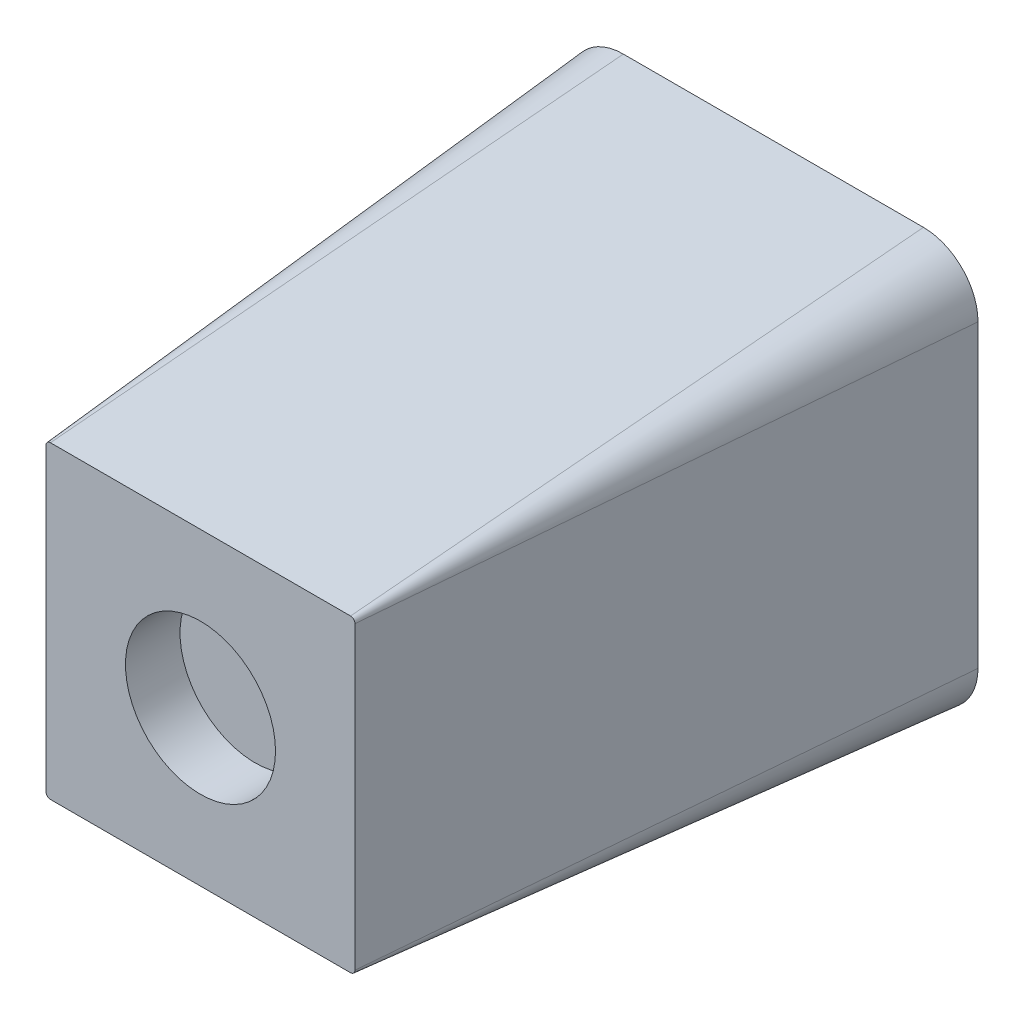
ISO-10303-21;
HEADER;
FILE_DESCRIPTION(('STEP AP214'),'2;1');
FILE_NAME('part.step','',(''),(''),'','','');
FILE_SCHEMA(('AUTOMOTIVE_DESIGN { 1 0 10303 214 1 1 1 1 }'));
ENDSEC;
DATA;
#1=APPLICATION_CONTEXT('core data for automotive mechanical design processes');
#2=APPLICATION_PROTOCOL_DEFINITION('international standard','automotive_design',2000,#1);
#3=PRODUCT_CONTEXT('',#1,'mechanical');
#4=PRODUCT('Part','Part','',(#3));
#5=PRODUCT_RELATED_PRODUCT_CATEGORY('part','',(#4));
#6=PRODUCT_DEFINITION_FORMATION('','',#4);
#7=PRODUCT_DEFINITION_CONTEXT('part definition',#1,'design');
#8=PRODUCT_DEFINITION('design','',#6,#7);
#9=PRODUCT_DEFINITION_SHAPE('','',#8);
#10=(LENGTH_UNIT() NAMED_UNIT(*) SI_UNIT(.MILLI.,.METRE.));
#11=(NAMED_UNIT(*) PLANE_ANGLE_UNIT() SI_UNIT($,.RADIAN.));
#12=(NAMED_UNIT(*) SI_UNIT($,.STERADIAN.) SOLID_ANGLE_UNIT());
#13=UNCERTAINTY_MEASURE_WITH_UNIT(LENGTH_MEASURE(1.E-05),#10,'distance_accuracy_value','');
#14=(GEOMETRIC_REPRESENTATION_CONTEXT(3) GLOBAL_UNCERTAINTY_ASSIGNED_CONTEXT((#13)) GLOBAL_UNIT_ASSIGNED_CONTEXT((#10,
#11,#12)) REPRESENTATION_CONTEXT('',''));
#15=CARTESIAN_POINT('',(0.,0.,0.));
#16=DIRECTION('',(0.,0.,1.));
#17=DIRECTION('',(1.,0.,0.));
#18=AXIS2_PLACEMENT_3D('',#15,#16,#17);
#19=CARTESIAN_POINT('',(-5.5,-5.5,0.));
#20=DIRECTION('',(0.,0.,-1.));
#21=DIRECTION('',(-1.,0.,0.));
#22=AXIS2_PLACEMENT_3D('',#19,#20,#21);
#23=CONICAL_SURFACE('',#22,2.,0.0872664625997167);
#24=CARTESIAN_POINT('',(-5.5,-5.5,0.));
#25=DIRECTION('',(0.,0.,1.));
#26=DIRECTION('',(-1.,0.,0.));
#27=AXIS2_PLACEMENT_3D('',#24,#25,#26);
#28=CIRCLE('',#27,2.);
#29=CARTESIAN_POINT('',(-7.5,-5.49999999999999,0.));
#30=VERTEX_POINT('',#29);
#31=CARTESIAN_POINT('',(-5.49999999999998,-7.5,0.));
#32=VERTEX_POINT('',#31);
#33=EDGE_CURVE('E111',#30,#32,#28,.T.);
#34=ORIENTED_EDGE('',*,*,#33,.T.);
#35=DIRECTION('',(0.,-0.0871557427476584,-0.996194698091745));
#36=VECTOR('',#35,1.);
#37=CARTESIAN_POINT('',(-5.49999999999998,-7.5,0.));
#38=LINE('',#37,#36);
#39=CARTESIAN_POINT('',(-5.49999999999998,-5.66273806595559,21.));
#40=VERTEX_POINT('',#39);
#41=EDGE_CURVE('E11',#40,#32,#38,.T.);
#42=ORIENTED_EDGE('',*,*,#41,.F.);
#43=CARTESIAN_POINT('',(-5.5,-5.5,21.));
#44=DIRECTION('',(0.,0.,-1.));
#45=DIRECTION('',(-1.,0.,0.));
#46=AXIS2_PLACEMENT_3D('',#43,#44,#45);
#47=CIRCLE('',#46,0.162738065955592);
#48=CARTESIAN_POINT('',(-5.66273806595559,-5.5,21.));
#49=VERTEX_POINT('',#48);
#50=EDGE_CURVE('E141',#49,#40,#47,.F.);
#51=ORIENTED_EDGE('',*,*,#50,.F.);
#52=DIRECTION('',(-0.0871557427476584,0.,-0.996194698091745));
#53=VECTOR('',#52,1.);
#54=CARTESIAN_POINT('',(-7.5,-5.49999999999999,0.));
#55=LINE('',#54,#53);
#56=EDGE_CURVE('E123',#49,#30,#55,.T.);
#57=ORIENTED_EDGE('',*,*,#56,.T.);
#58=EDGE_LOOP('',(#34,#42,#51,#57));
#59=FACE_BOUND('',#58,.T.);
#60=ADVANCED_FACE('F41',(#59),#23,.T.);
#61=CARTESIAN_POINT('',(-5.49999999999998,-7.5,0.));
#62=DIRECTION('',(0.,-0.996194698091746,0.0871557427476584));
#63=DIRECTION('',(0.,-0.0871557427476584,-0.996194698091746));
#64=AXIS2_PLACEMENT_3D('',#61,#62,#63);
#65=PLANE('',#64);
#66=DIRECTION('',(1.,0.,0.));
#67=VECTOR('',#66,1.);
#68=CARTESIAN_POINT('',(-5.49999999999998,-7.5,0.));
#69=LINE('',#68,#67);
#70=CARTESIAN_POINT('',(5.49999999999999,-7.5,0.));
#71=VERTEX_POINT('',#70);
#72=EDGE_CURVE('E107',#32,#71,#69,.T.);
#73=ORIENTED_EDGE('',*,*,#72,.T.);
#74=DIRECTION('',(0.,-0.0871557427476584,-0.996194698091745));
#75=VECTOR('',#74,1.);
#76=CARTESIAN_POINT('',(5.49999999999999,-7.5,0.));
#77=LINE('',#76,#75);
#78=CARTESIAN_POINT('',(5.5,-5.66273806595559,21.));
#79=VERTEX_POINT('',#78);
#80=EDGE_CURVE('E50',#79,#71,#77,.T.);
#81=ORIENTED_EDGE('',*,*,#80,.F.);
#82=DIRECTION('',(-1.,0.,0.));
#83=VECTOR('',#82,1.);
#84=CARTESIAN_POINT('',(-5.5,-5.66273806595559,21.));
#85=LINE('',#84,#83);
#86=EDGE_CURVE('E119',#40,#79,#85,.F.);
#87=ORIENTED_EDGE('',*,*,#86,.F.);
#88=ORIENTED_EDGE('',*,*,#41,.T.);
#89=EDGE_LOOP('',(#73,#81,#87,#88));
#90=FACE_BOUND('',#89,.T.);
#91=ADVANCED_FACE('F43',(#90),#65,.T.);
#92=CARTESIAN_POINT('',(5.5,-5.5,0.));
#93=DIRECTION('',(0.,0.,-1.));
#94=DIRECTION('',(1.,0.,0.));
#95=AXIS2_PLACEMENT_3D('',#92,#93,#94);
#96=CONICAL_SURFACE('',#95,2.,0.0872664625997167);
#97=CARTESIAN_POINT('',(5.5,-5.5,0.));
#98=DIRECTION('',(0.,0.,1.));
#99=DIRECTION('',(1.,0.,0.));
#100=AXIS2_PLACEMENT_3D('',#97,#98,#99);
#101=CIRCLE('',#100,2.);
#102=CARTESIAN_POINT('',(7.5,-5.5,0.));
#103=VERTEX_POINT('',#102);
#104=EDGE_CURVE('E113',#71,#103,#101,.T.);
#105=ORIENTED_EDGE('',*,*,#104,.T.);
#106=DIRECTION('',(0.0871557427476584,0.,-0.996194698091745));
#107=VECTOR('',#106,1.);
#108=CARTESIAN_POINT('',(7.5,-5.5,0.));
#109=LINE('',#108,#107);
#110=CARTESIAN_POINT('',(5.66273806595559,-5.5,21.));
#111=VERTEX_POINT('',#110);
#112=EDGE_CURVE('E156',#111,#103,#109,.T.);
#113=ORIENTED_EDGE('',*,*,#112,.F.);
#114=CARTESIAN_POINT('',(5.5,-5.5,21.));
#115=DIRECTION('',(0.,0.,-1.));
#116=DIRECTION('',(-1.,0.,0.));
#117=AXIS2_PLACEMENT_3D('',#114,#115,#116);
#118=CIRCLE('',#117,0.162738065955592);
#119=EDGE_CURVE('E162',#79,#111,#118,.F.);
#120=ORIENTED_EDGE('',*,*,#119,.F.);
#121=ORIENTED_EDGE('',*,*,#80,.T.);
#122=EDGE_LOOP('',(#105,#113,#120,#121));
#123=FACE_BOUND('',#122,.T.);
#124=ADVANCED_FACE('F185',(#123),#96,.T.);
#125=CARTESIAN_POINT('',(7.5,-5.49999999999999,0.));
#126=DIRECTION('',(0.996194698091746,0.,0.0871557427476584));
#127=DIRECTION('',(0.0871557427476584,0.,-0.996194698091746));
#128=AXIS2_PLACEMENT_3D('',#125,#126,#127);
#129=PLANE('',#128);
#130=DIRECTION('',(0.,1.,0.));
#131=VECTOR('',#130,1.);
#132=CARTESIAN_POINT('',(7.5,-5.49999999999999,0.));
#133=LINE('',#132,#131);
#134=CARTESIAN_POINT('',(7.5,5.49999999999999,0.));
#135=VERTEX_POINT('',#134);
#136=EDGE_CURVE('E132',#103,#135,#133,.T.);
#137=ORIENTED_EDGE('',*,*,#136,.T.);
#138=DIRECTION('',(0.0871557427476584,0.,-0.996194698091745));
#139=VECTOR('',#138,1.);
#140=CARTESIAN_POINT('',(7.5,5.49999999999999,0.));
#141=LINE('',#140,#139);
#142=CARTESIAN_POINT('',(5.66273806595559,5.5,21.));
#143=VERTEX_POINT('',#142);
#144=EDGE_CURVE('E153',#143,#135,#141,.T.);
#145=ORIENTED_EDGE('',*,*,#144,.F.);
#146=DIRECTION('',(0.,-1.,0.));
#147=VECTOR('',#146,1.);
#148=CARTESIAN_POINT('',(5.66273806595559,-5.5,21.));
#149=LINE('',#148,#147);
#150=EDGE_CURVE('E164',#111,#143,#149,.F.);
#151=ORIENTED_EDGE('',*,*,#150,.F.);
#152=ORIENTED_EDGE('',*,*,#112,.T.);
#153=EDGE_LOOP('',(#137,#145,#151,#152));
#154=FACE_BOUND('',#153,.T.);
#155=ADVANCED_FACE('F189',(#154),#129,.T.);
#156=CARTESIAN_POINT('',(5.5,5.5,0.));
#157=DIRECTION('',(0.,0.,-1.));
#158=DIRECTION('',(-1.,0.,0.));
#159=AXIS2_PLACEMENT_3D('',#156,#157,#158);
#160=CONICAL_SURFACE('',#159,2.,0.0872664625997167);
#161=CARTESIAN_POINT('',(5.5,5.5,0.));
#162=DIRECTION('',(0.,0.,1.));
#163=DIRECTION('',(-1.,0.,0.));
#164=AXIS2_PLACEMENT_3D('',#161,#162,#163);
#165=CIRCLE('',#164,2.);
#166=CARTESIAN_POINT('',(5.49999999999999,7.5,0.));
#167=VERTEX_POINT('',#166);
#168=EDGE_CURVE('E134',#135,#167,#165,.T.);
#169=ORIENTED_EDGE('',*,*,#168,.T.);
#170=DIRECTION('',(0.,0.0871557427476584,-0.996194698091745));
#171=VECTOR('',#170,1.);
#172=CARTESIAN_POINT('',(5.49999999999999,7.5,0.));
#173=LINE('',#172,#171);
#174=CARTESIAN_POINT('',(5.49999999999999,5.66273806595559,21.));
#175=VERTEX_POINT('',#174);
#176=EDGE_CURVE('E150',#175,#167,#173,.T.);
#177=ORIENTED_EDGE('',*,*,#176,.F.);
#178=CARTESIAN_POINT('',(5.5,5.5,21.));
#179=DIRECTION('',(0.,0.,-1.));
#180=DIRECTION('',(-1.,0.,0.));
#181=AXIS2_PLACEMENT_3D('',#178,#179,#180);
#182=CIRCLE('',#181,0.162738065955592);
#183=EDGE_CURVE('E166',#143,#175,#182,.F.);
#184=ORIENTED_EDGE('',*,*,#183,.F.);
#185=ORIENTED_EDGE('',*,*,#144,.T.);
#186=EDGE_LOOP('',(#169,#177,#184,#185));
#187=FACE_BOUND('',#186,.T.);
#188=ADVANCED_FACE('F192',(#187),#160,.T.);
#189=CARTESIAN_POINT('',(-5.49999999999998,7.5,0.));
#190=DIRECTION('',(0.,0.996194698091746,0.0871557427476584));
#191=DIRECTION('',(0.,-0.0871557427476584,0.996194698091746));
#192=AXIS2_PLACEMENT_3D('',#189,#190,#191);
#193=PLANE('',#192);
#194=DIRECTION('',(-1.,0.,0.));
#195=VECTOR('',#194,1.);
#196=CARTESIAN_POINT('',(-5.49999999999998,7.5,0.));
#197=LINE('',#196,#195);
#198=CARTESIAN_POINT('',(-5.49999999999998,7.5,0.));
#199=VERTEX_POINT('',#198);
#200=EDGE_CURVE('E136',#167,#199,#197,.T.);
#201=ORIENTED_EDGE('',*,*,#200,.T.);
#202=DIRECTION('',(0.,0.0871557427476584,-0.996194698091745));
#203=VECTOR('',#202,1.);
#204=CARTESIAN_POINT('',(-5.49999999999998,7.5,0.));
#205=LINE('',#204,#203);
#206=CARTESIAN_POINT('',(-5.5,5.66273806595559,21.));
#207=VERTEX_POINT('',#206);
#208=EDGE_CURVE('E147',#207,#199,#205,.T.);
#209=ORIENTED_EDGE('',*,*,#208,.F.);
#210=DIRECTION('',(1.,0.,0.));
#211=VECTOR('',#210,1.);
#212=CARTESIAN_POINT('',(-5.5,5.66273806595559,21.));
#213=LINE('',#212,#211);
#214=EDGE_CURVE('E168',#175,#207,#213,.F.);
#215=ORIENTED_EDGE('',*,*,#214,.F.);
#216=ORIENTED_EDGE('',*,*,#176,.T.);
#217=EDGE_LOOP('',(#201,#209,#215,#216));
#218=FACE_BOUND('',#217,.T.);
#219=ADVANCED_FACE('F175',(#218),#193,.T.);
#220=CARTESIAN_POINT('',(-5.5,5.5,0.));
#221=DIRECTION('',(0.,0.,-1.));
#222=DIRECTION('',(-1.,0.,0.));
#223=AXIS2_PLACEMENT_3D('',#220,#221,#222);
#224=CONICAL_SURFACE('',#223,2.,0.0872664625997167);
#225=CARTESIAN_POINT('',(-5.5,5.5,0.));
#226=DIRECTION('',(0.,0.,1.));
#227=DIRECTION('',(-1.,0.,0.));
#228=AXIS2_PLACEMENT_3D('',#225,#226,#227);
#229=CIRCLE('',#228,2.);
#230=CARTESIAN_POINT('',(-7.5,5.49999999999999,0.));
#231=VERTEX_POINT('',#230);
#232=EDGE_CURVE('E138',#199,#231,#229,.T.);
#233=ORIENTED_EDGE('',*,*,#232,.T.);
#234=DIRECTION('',(-0.0871557427476584,0.,-0.996194698091745));
#235=VECTOR('',#234,1.);
#236=CARTESIAN_POINT('',(-7.5,5.49999999999999,0.));
#237=LINE('',#236,#235);
#238=CARTESIAN_POINT('',(-5.66273806595559,5.49999999999999,21.));
#239=VERTEX_POINT('',#238);
#240=EDGE_CURVE('E144',#239,#231,#237,.T.);
#241=ORIENTED_EDGE('',*,*,#240,.F.);
#242=CARTESIAN_POINT('',(-5.5,5.5,21.));
#243=DIRECTION('',(0.,0.,-1.));
#244=DIRECTION('',(-1.,0.,0.));
#245=AXIS2_PLACEMENT_3D('',#242,#243,#244);
#246=CIRCLE('',#245,0.162738065955592);
#247=EDGE_CURVE('E62',#207,#239,#246,.F.);
#248=ORIENTED_EDGE('',*,*,#247,.F.);
#249=ORIENTED_EDGE('',*,*,#208,.T.);
#250=EDGE_LOOP('',(#233,#241,#248,#249));
#251=FACE_BOUND('',#250,.T.);
#252=ADVANCED_FACE('F179',(#251),#224,.T.);
#253=CARTESIAN_POINT('',(-7.5,-5.49999999999999,0.));
#254=DIRECTION('',(-0.996194698091746,0.,0.0871557427476584));
#255=DIRECTION('',(0.0871557427476584,0.,0.996194698091746));
#256=AXIS2_PLACEMENT_3D('',#253,#254,#255);
#257=PLANE('',#256);
#258=DIRECTION('',(0.,-1.,0.));
#259=VECTOR('',#258,1.);
#260=CARTESIAN_POINT('',(-7.5,-5.49999999999999,0.));
#261=LINE('',#260,#259);
#262=EDGE_CURVE('E140',#231,#30,#261,.T.);
#263=ORIENTED_EDGE('',*,*,#262,.T.);
#264=ORIENTED_EDGE('',*,*,#56,.F.);
#265=DIRECTION('',(0.,1.,0.));
#266=VECTOR('',#265,1.);
#267=CARTESIAN_POINT('',(-5.66273806595559,-5.5,21.));
#268=LINE('',#267,#266);
#269=EDGE_CURVE('E45',#239,#49,#268,.F.);
#270=ORIENTED_EDGE('',*,*,#269,.F.);
#271=ORIENTED_EDGE('',*,*,#240,.T.);
#272=EDGE_LOOP('',(#263,#264,#270,#271));
#273=FACE_BOUND('',#272,.T.);
#274=ADVANCED_FACE('F181',(#273),#257,.T.);
#275=CARTESIAN_POINT('',(-5.5,-5.5,21.));
#276=DIRECTION('',(0.,0.,-1.));
#277=DIRECTION('',(-1.,0.,0.));
#278=AXIS2_PLACEMENT_3D('',#275,#276,#277);
#279=PLANE('',#278);
#280=CARTESIAN_POINT('',(0.,0.,21.));
#281=DIRECTION('',(0.,0.,1.));
#282=DIRECTION('',(1.,0.,0.));
#283=AXIS2_PLACEMENT_3D('',#280,#281,#282);
#284=CIRCLE('',#283,2.75);
#285=CARTESIAN_POINT('',(2.75,0.,21.));
#286=VERTEX_POINT('',#285);
#287=EDGE_CURVE('E316',#286,#286,#284,.T.);
#288=ORIENTED_EDGE('',*,*,#287,.F.);
#289=EDGE_LOOP('',(#288));
#290=FACE_BOUND('',#289,.T.);
#291=ORIENTED_EDGE('',*,*,#50,.T.);
#292=ORIENTED_EDGE('',*,*,#86,.T.);
#293=ORIENTED_EDGE('',*,*,#119,.T.);
#294=ORIENTED_EDGE('',*,*,#150,.T.);
#295=ORIENTED_EDGE('',*,*,#183,.T.);
#296=ORIENTED_EDGE('',*,*,#214,.T.);
#297=ORIENTED_EDGE('',*,*,#247,.T.);
#298=ORIENTED_EDGE('',*,*,#269,.T.);
#299=EDGE_LOOP('',(#291,#292,#293,#294,#295,#296,#297,#298));
#300=FACE_BOUND('',#299,.T.);
#301=ADVANCED_FACE('F171',(#290,#300),#279,.F.);
#302=CARTESIAN_POINT('',(-5.5,-5.5,0.));
#303=DIRECTION('',(0.,0.,-1.));
#304=DIRECTION('',(-1.,0.,0.));
#305=AXIS2_PLACEMENT_3D('',#302,#303,#304);
#306=PLANE('',#305);
#307=CARTESIAN_POINT('',(0.,0.,0.));
#308=DIRECTION('',(0.,0.,-1.));
#309=DIRECTION('',(-1.,0.,0.));
#310=AXIS2_PLACEMENT_3D('',#307,#308,#309);
#311=CIRCLE('',#310,1.5);
#312=CARTESIAN_POINT('',(-1.5,0.,0.));
#313=VERTEX_POINT('',#312);
#314=EDGE_CURVE('E127',#313,#313,#311,.T.);
#315=ORIENTED_EDGE('',*,*,#314,.F.);
#316=EDGE_LOOP('',(#315));
#317=FACE_BOUND('',#316,.T.);
#318=ORIENTED_EDGE('',*,*,#33,.F.);
#319=ORIENTED_EDGE('',*,*,#262,.F.);
#320=ORIENTED_EDGE('',*,*,#232,.F.);
#321=ORIENTED_EDGE('',*,*,#200,.F.);
#322=ORIENTED_EDGE('',*,*,#168,.F.);
#323=ORIENTED_EDGE('',*,*,#136,.F.);
#324=ORIENTED_EDGE('',*,*,#104,.F.);
#325=ORIENTED_EDGE('',*,*,#72,.F.);
#326=EDGE_LOOP('',(#318,#319,#320,#321,#322,#323,#324,#325));
#327=FACE_BOUND('',#326,.T.);
#328=ADVANCED_FACE('F108',(#317,#327),#306,.T.);
#329=CARTESIAN_POINT('',(0.,0.,10.));
#330=DIRECTION('',(0.,0.,-1.));
#331=DIRECTION('',(-1.,0.,0.));
#332=AXIS2_PLACEMENT_3D('',#329,#330,#331);
#333=CYLINDRICAL_SURFACE('',#332,1.5);
#334=CARTESIAN_POINT('',(0.,0.,10.));
#335=DIRECTION('',(0.,0.,-1.));
#336=DIRECTION('',(-1.,0.,0.));
#337=AXIS2_PLACEMENT_3D('',#334,#335,#336);
#338=CIRCLE('',#337,1.5);
#339=CARTESIAN_POINT('',(-1.5,0.,10.));
#340=VERTEX_POINT('',#339);
#341=EDGE_CURVE('E124',#340,#340,#338,.T.);
#342=ORIENTED_EDGE('',*,*,#341,.F.);
#343=EDGE_LOOP('',(#342));
#344=FACE_BOUND('',#343,.T.);
#345=ORIENTED_EDGE('',*,*,#314,.T.);
#346=EDGE_LOOP('',(#345));
#347=FACE_BOUND('',#346,.T.);
#348=ADVANCED_FACE('F229',(#344,#347),#333,.F.);
#349=CARTESIAN_POINT('',(0.,0.,10.));
#350=DIRECTION('',(0.,0.,-1.));
#351=DIRECTION('',(-1.,0.,0.));
#352=AXIS2_PLACEMENT_3D('',#349,#350,#351);
#353=PLANE('',#352);
#354=ORIENTED_EDGE('',*,*,#341,.T.);
#355=EDGE_LOOP('',(#354));
#356=FACE_BOUND('',#355,.T.);
#357=ADVANCED_FACE('F237',(#356),#353,.T.);
#358=CARTESIAN_POINT('',(0.,0.,19.));
#359=DIRECTION('',(0.,0.,1.));
#360=DIRECTION('',(1.,0.,0.));
#361=AXIS2_PLACEMENT_3D('',#358,#359,#360);
#362=CYLINDRICAL_SURFACE('',#361,2.75);
#363=CARTESIAN_POINT('',(0.,0.,19.));
#364=DIRECTION('',(0.,0.,1.));
#365=DIRECTION('',(1.,0.,0.));
#366=AXIS2_PLACEMENT_3D('',#363,#364,#365);
#367=CIRCLE('',#366,2.75);
#368=CARTESIAN_POINT('',(2.75,0.,19.));
#369=VERTEX_POINT('',#368);
#370=EDGE_CURVE('E315',#369,#369,#367,.T.);
#371=ORIENTED_EDGE('',*,*,#370,.F.);
#372=EDGE_LOOP('',(#371));
#373=FACE_BOUND('',#372,.T.);
#374=ORIENTED_EDGE('',*,*,#287,.T.);
#375=EDGE_LOOP('',(#374));
#376=FACE_BOUND('',#375,.T.);
#377=ADVANCED_FACE('F246',(#373,#376),#362,.F.);
#378=CARTESIAN_POINT('',(0.,0.,19.));
#379=DIRECTION('',(0.,0.,1.));
#380=DIRECTION('',(1.,0.,0.));
#381=AXIS2_PLACEMENT_3D('',#378,#379,#380);
#382=PLANE('',#381);
#383=ORIENTED_EDGE('',*,*,#370,.T.);
#384=EDGE_LOOP('',(#383));
#385=FACE_BOUND('',#384,.T.);
#386=ADVANCED_FACE('F261',(#385),#382,.T.);
#387=CLOSED_SHELL('',(#60,#91,#124,#155,#188,#219,#252,#274,#301,#328,#348,#357,#377,#386));
#388=MANIFOLD_SOLID_BREP('B2',#387);
#389=ADVANCED_BREP_SHAPE_REPRESENTATION('',(#18,#388),#14);
#390=SHAPE_DEFINITION_REPRESENTATION(#9,#389);
ENDSEC;
END-ISO-10303-21;
